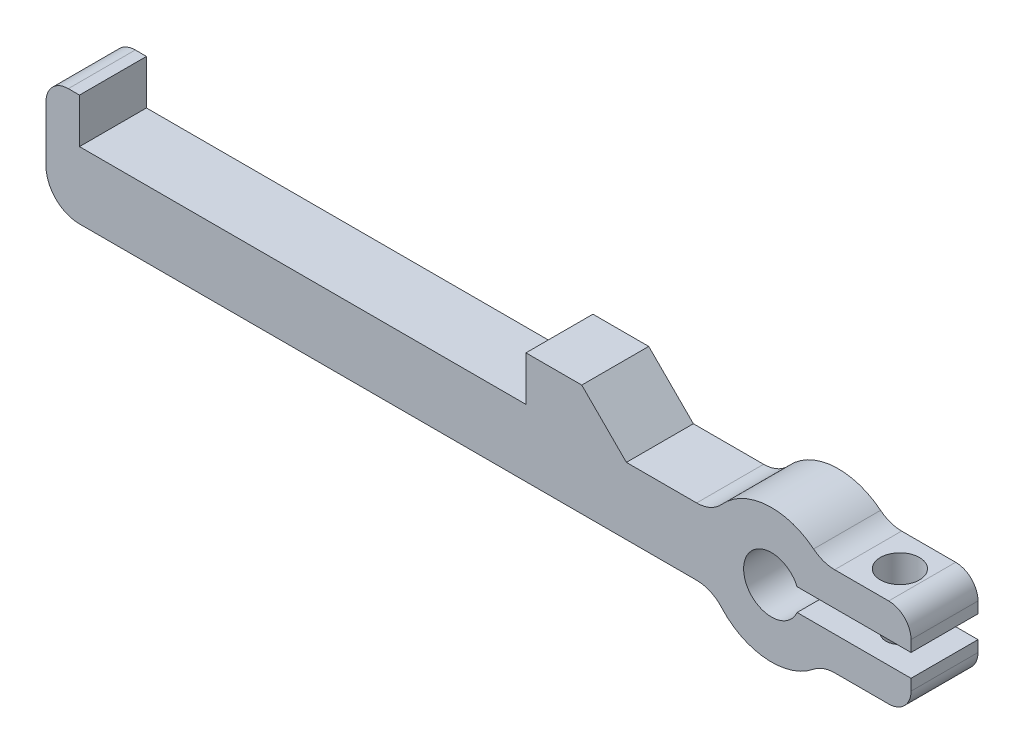
ISO-10303-21;
HEADER;
FILE_DESCRIPTION(('STEP AP214'),'2;1');
FILE_NAME('part.step','',(''),(''),'','','');
FILE_SCHEMA(('AUTOMOTIVE_DESIGN { 1 0 10303 214 1 1 1 1 }'));
ENDSEC;
DATA;
#1=APPLICATION_CONTEXT('core data for automotive mechanical design processes');
#2=APPLICATION_PROTOCOL_DEFINITION('international standard','automotive_design',2000,#1);
#3=PRODUCT_CONTEXT('',#1,'mechanical');
#4=PRODUCT('Part','Part','',(#3));
#5=PRODUCT_RELATED_PRODUCT_CATEGORY('part','',(#4));
#6=PRODUCT_DEFINITION_FORMATION('','',#4);
#7=PRODUCT_DEFINITION_CONTEXT('part definition',#1,'design');
#8=PRODUCT_DEFINITION('design','',#6,#7);
#9=PRODUCT_DEFINITION_SHAPE('','',#8);
#10=(LENGTH_UNIT() NAMED_UNIT(*) SI_UNIT(.MILLI.,.METRE.));
#11=(NAMED_UNIT(*) PLANE_ANGLE_UNIT() SI_UNIT($,.RADIAN.));
#12=(NAMED_UNIT(*) SI_UNIT($,.STERADIAN.) SOLID_ANGLE_UNIT());
#13=UNCERTAINTY_MEASURE_WITH_UNIT(LENGTH_MEASURE(1.E-05),#10,'distance_accuracy_value','');
#14=(GEOMETRIC_REPRESENTATION_CONTEXT(3) GLOBAL_UNCERTAINTY_ASSIGNED_CONTEXT((#13)) GLOBAL_UNIT_ASSIGNED_CONTEXT((#10,
#11,#12)) REPRESENTATION_CONTEXT('',''));
#15=CARTESIAN_POINT('',(0.,0.,0.));
#16=DIRECTION('',(0.,0.,1.));
#17=DIRECTION('',(1.,0.,0.));
#18=AXIS2_PLACEMENT_3D('',#15,#16,#17);
#19=CARTESIAN_POINT('',(-65.,3.,-62.2896460095897));
#20=DIRECTION('',(0.,1.,0.));
#21=DIRECTION('',(0.,0.,1.));
#22=AXIS2_PLACEMENT_3D('',#19,#20,#21);
#23=PLANE('',#22);
#24=DIRECTION('',(1.,0.,0.));
#25=VECTOR('',#24,1.);
#26=CARTESIAN_POINT('',(-65.,3.,0.));
#27=LINE('',#26,#25);
#28=CARTESIAN_POINT('',(-12.9999999999999,3.,0.));
#29=VERTEX_POINT('',#28);
#30=CARTESIAN_POINT('',(-6.70820393249937,3.,0.));
#31=VERTEX_POINT('',#30);
#32=EDGE_CURVE('E298',#29,#31,#27,.T.);
#33=ORIENTED_EDGE('',*,*,#32,.F.);
#34=DIRECTION('',(0.,0.,1.));
#35=VECTOR('',#34,1.);
#36=CARTESIAN_POINT('',(-12.9999999999999,3.,6.));
#37=LINE('',#36,#35);
#38=CARTESIAN_POINT('',(-12.9999999999999,3.,6.));
#39=VERTEX_POINT('',#38);
#40=EDGE_CURVE('E393',#29,#39,#37,.T.);
#41=ORIENTED_EDGE('',*,*,#40,.T.);
#42=DIRECTION('',(-1.,0.,0.));
#43=VECTOR('',#42,1.);
#44=CARTESIAN_POINT('',(-65.,3.,6.));
#45=LINE('',#44,#43);
#46=CARTESIAN_POINT('',(-6.70820393249937,3.,6.));
#47=VERTEX_POINT('',#46);
#48=EDGE_CURVE('E306',#47,#39,#45,.T.);
#49=ORIENTED_EDGE('',*,*,#48,.F.);
#50=DIRECTION('',(0.,0.,-1.));
#51=VECTOR('',#50,1.);
#52=CARTESIAN_POINT('',(-6.70820393249937,3.,-62.2896460095897));
#53=LINE('',#52,#51);
#54=EDGE_CURVE('E354',#47,#31,#53,.T.);
#55=ORIENTED_EDGE('',*,*,#54,.T.);
#56=EDGE_LOOP('',(#33,#41,#49,#55));
#57=FACE_BOUND('',#56,.T.);
#58=ADVANCED_FACE('F32',(#57),#23,.T.);
#59=CARTESIAN_POINT('',(12.5,4.,-12.8062484748657));
#60=DIRECTION('',(1.,0.,0.));
#61=DIRECTION('',(0.,0.,-1.));
#62=AXIS2_PLACEMENT_3D('',#59,#60,#61);
#63=PLANE('',#62);
#64=DIRECTION('',(0.,1.,0.));
#65=VECTOR('',#64,1.);
#66=CARTESIAN_POINT('',(12.5,4.,6.));
#67=LINE('',#66,#65);
#68=CARTESIAN_POINT('',(12.5,-2.,6.));
#69=VERTEX_POINT('',#68);
#70=CARTESIAN_POINT('',(12.5,-0.999999999999998,6.));
#71=VERTEX_POINT('',#70);
#72=EDGE_CURVE('E290',#69,#71,#67,.T.);
#73=ORIENTED_EDGE('',*,*,#72,.F.);
#74=DIRECTION('',(0.,0.,1.));
#75=VECTOR('',#74,1.);
#76=CARTESIAN_POINT('',(12.5,-2.,-12.8062484748657));
#77=LINE('',#76,#75);
#78=CARTESIAN_POINT('',(12.5,-2.,0.));
#79=VERTEX_POINT('',#78);
#80=EDGE_CURVE('E382',#69,#79,#77,.F.);
#81=ORIENTED_EDGE('',*,*,#80,.T.);
#82=DIRECTION('',(0.,-1.,0.));
#83=VECTOR('',#82,1.);
#84=CARTESIAN_POINT('',(12.5,4.,0.));
#85=LINE('',#84,#83);
#86=CARTESIAN_POINT('',(12.5,-0.999999999999999,0.));
#87=VERTEX_POINT('',#86);
#88=EDGE_CURVE('E283',#87,#79,#85,.T.);
#89=ORIENTED_EDGE('',*,*,#88,.F.);
#90=DIRECTION('',(0.,0.,1.));
#91=VECTOR('',#90,1.);
#92=CARTESIAN_POINT('',(12.5,-0.999999999999999,0.));
#93=LINE('',#92,#91);
#94=EDGE_CURVE('E266',#87,#71,#93,.T.);
#95=ORIENTED_EDGE('',*,*,#94,.T.);
#96=EDGE_LOOP('',(#73,#81,#89,#95));
#97=FACE_BOUND('',#96,.T.);
#98=ADVANCED_FACE('F425',(#97),#63,.T.);
#99=CARTESIAN_POINT('',(0.,0.,6.));
#100=DIRECTION('',(0.,0.,-1.));
#101=DIRECTION('',(-1.,0.,0.));
#102=AXIS2_PLACEMENT_3D('',#99,#100,#101);
#103=CYLINDRICAL_SURFACE('',#102,6.);
#104=CARTESIAN_POINT('',(0.,0.,6.));
#105=DIRECTION('',(0.,0.,1.));
#106=DIRECTION('',(1.,0.,0.));
#107=AXIS2_PLACEMENT_3D('',#104,#105,#106);
#108=CIRCLE('',#107,6.);
#109=CARTESIAN_POINT('',(3.77123616632825,4.66666666666667,6.));
#110=VERTEX_POINT('',#109);
#111=CARTESIAN_POINT('',(-4.47213595499958,4.,6.));
#112=VERTEX_POINT('',#111);
#113=EDGE_CURVE('E322',#110,#112,#108,.T.);
#114=ORIENTED_EDGE('',*,*,#113,.F.);
#115=DIRECTION('',(0.,0.,-1.));
#116=VECTOR('',#115,1.);
#117=CARTESIAN_POINT('',(3.77123616632826,4.66666666666667,6.));
#118=LINE('',#117,#116);
#119=CARTESIAN_POINT('',(3.77123616632825,4.66666666666667,0.));
#120=VERTEX_POINT('',#119);
#121=EDGE_CURVE('E348',#110,#120,#118,.T.);
#122=ORIENTED_EDGE('',*,*,#121,.T.);
#123=CARTESIAN_POINT('',(0.,0.,0.));
#124=DIRECTION('',(0.,0.,1.));
#125=DIRECTION('',(1.,0.,0.));
#126=AXIS2_PLACEMENT_3D('',#123,#124,#125);
#127=CIRCLE('',#126,6.);
#128=CARTESIAN_POINT('',(-4.47213595499958,4.,0.));
#129=VERTEX_POINT('',#128);
#130=EDGE_CURVE('E315',#120,#129,#127,.T.);
#131=ORIENTED_EDGE('',*,*,#130,.T.);
#132=DIRECTION('',(0.,0.,-1.));
#133=VECTOR('',#132,1.);
#134=CARTESIAN_POINT('',(-4.47213595499958,4.,6.));
#135=LINE('',#134,#133);
#136=EDGE_CURVE('E345',#129,#112,#135,.F.);
#137=ORIENTED_EDGE('',*,*,#136,.T.);
#138=EDGE_LOOP('',(#114,#122,#131,#137));
#139=FACE_BOUND('',#138,.T.);
#140=ADVANCED_FACE('F432',(#139),#103,.T.);
#141=CARTESIAN_POINT('',(0.,0.,6.));
#142=DIRECTION('',(0.,0.,1.));
#143=DIRECTION('',(1.,0.,0.));
#144=AXIS2_PLACEMENT_3D('',#141,#142,#143);
#145=PLANE('',#144);
#146=DIRECTION('',(-1.,0.,0.));
#147=VECTOR('',#146,1.);
#148=CARTESIAN_POINT('',(-65.,7.,6.));
#149=LINE('',#148,#147);
#150=CARTESIAN_POINT('',(-62.,7.00000000000001,6.));
#151=VERTEX_POINT('',#150);
#152=CARTESIAN_POINT('',(-63.,7.00000000000001,6.));
#153=VERTEX_POINT('',#152);
#154=EDGE_CURVE('E238',#151,#153,#149,.T.);
#155=ORIENTED_EDGE('',*,*,#154,.T.);
#156=CARTESIAN_POINT('',(-63.,5.00000000000001,6.));
#157=DIRECTION('',(0.,0.,1.));
#158=DIRECTION('',(1.,0.,0.));
#159=AXIS2_PLACEMENT_3D('',#156,#157,#158);
#160=CIRCLE('',#159,2.);
#161=CARTESIAN_POINT('',(-65.,5.00000000000001,6.));
#162=VERTEX_POINT('',#161);
#163=EDGE_CURVE('E54',#153,#162,#160,.T.);
#164=ORIENTED_EDGE('',*,*,#163,.T.);
#165=DIRECTION('',(0.,-1.,0.));
#166=VECTOR('',#165,1.);
#167=CARTESIAN_POINT('',(-65.,3.,6.));
#168=LINE('',#167,#166);
#169=CARTESIAN_POINT('',(-65.,0.,6.));
#170=VERTEX_POINT('',#169);
#171=EDGE_CURVE('E295',#162,#170,#168,.T.);
#172=ORIENTED_EDGE('',*,*,#171,.T.);
#173=CARTESIAN_POINT('',(-62.,0.,6.));
#174=DIRECTION('',(0.,0.,1.));
#175=DIRECTION('',(1.,0.,0.));
#176=AXIS2_PLACEMENT_3D('',#173,#174,#175);
#177=CIRCLE('',#176,3.);
#178=CARTESIAN_POINT('',(-62.,-3.,6.));
#179=VERTEX_POINT('',#178);
#180=EDGE_CURVE('E328',#170,#179,#177,.T.);
#181=ORIENTED_EDGE('',*,*,#180,.T.);
#182=DIRECTION('',(1.,0.,0.));
#183=VECTOR('',#182,1.);
#184=CARTESIAN_POINT('',(-65.,-3.,6.));
#185=LINE('',#184,#183);
#186=CARTESIAN_POINT('',(-6.70820393249937,-3.,6.));
#187=VERTEX_POINT('',#186);
#188=EDGE_CURVE('E302',#179,#187,#185,.T.);
#189=ORIENTED_EDGE('',*,*,#188,.T.);
#190=CARTESIAN_POINT('',(-6.70820393249937,-6.,6.));
#191=DIRECTION('',(0.,0.,1.));
#192=DIRECTION('',(1.,0.,0.));
#193=AXIS2_PLACEMENT_3D('',#190,#191,#192);
#194=CIRCLE('',#193,3.);
#195=CARTESIAN_POINT('',(-4.47213595499958,-4.,6.));
#196=VERTEX_POINT('',#195);
#197=EDGE_CURVE('E371',#187,#196,#194,.F.);
#198=ORIENTED_EDGE('',*,*,#197,.T.);
#199=CARTESIAN_POINT('',(3.77123616632826,-4.66666666666666,6.));
#200=VERTEX_POINT('',#199);
#201=EDGE_CURVE('E318',#196,#200,#108,.T.);
#202=ORIENTED_EDGE('',*,*,#201,.T.);
#203=CARTESIAN_POINT('',(5.65685424949238,-7.,6.));
#204=DIRECTION('',(0.,0.,1.));
#205=DIRECTION('',(1.,0.,0.));
#206=AXIS2_PLACEMENT_3D('',#203,#204,#205);
#207=CIRCLE('',#206,3.);
#208=CARTESIAN_POINT('',(5.65685424949238,-4.,6.));
#209=VERTEX_POINT('',#208);
#210=EDGE_CURVE('E357',#200,#209,#207,.F.);
#211=ORIENTED_EDGE('',*,*,#210,.T.);
#212=DIRECTION('',(1.,0.,0.));
#213=VECTOR('',#212,1.);
#214=CARTESIAN_POINT('',(2.5,-4.,6.));
#215=LINE('',#214,#213);
#216=CARTESIAN_POINT('',(10.5,-4.,6.));
#217=VERTEX_POINT('',#216);
#218=EDGE_CURVE('E279',#209,#217,#215,.T.);
#219=ORIENTED_EDGE('',*,*,#218,.T.);
#220=CARTESIAN_POINT('',(10.5,-2.,6.));
#221=DIRECTION('',(0.,0.,1.));
#222=DIRECTION('',(1.,0.,0.));
#223=AXIS2_PLACEMENT_3D('',#220,#221,#222);
#224=CIRCLE('',#223,2.);
#225=EDGE_CURVE('E380',#217,#69,#224,.T.);
#226=ORIENTED_EDGE('',*,*,#225,.T.);
#227=ORIENTED_EDGE('',*,*,#72,.T.);
#228=DIRECTION('',(1.,0.,0.));
#229=VECTOR('',#228,1.);
#230=CARTESIAN_POINT('',(0.,-1.,6.));
#231=LINE('',#230,#229);
#232=CARTESIAN_POINT('',(2.29128784747792,-1.,6.));
#233=VERTEX_POINT('',#232);
#234=EDGE_CURVE('E276',#233,#71,#231,.T.);
#235=ORIENTED_EDGE('',*,*,#234,.F.);
#236=CARTESIAN_POINT('',(0.,0.,6.));
#237=DIRECTION('',(0.,0.,1.));
#238=DIRECTION('',(1.,0.,0.));
#239=AXIS2_PLACEMENT_3D('',#236,#237,#238);
#240=CIRCLE('',#239,2.5);
#241=CARTESIAN_POINT('',(2.29128784747792,1.,6.));
#242=VERTEX_POINT('',#241);
#243=EDGE_CURVE('E312',#242,#233,#240,.T.);
#244=ORIENTED_EDGE('',*,*,#243,.F.);
#245=DIRECTION('',(-1.,0.,0.));
#246=VECTOR('',#245,1.);
#247=CARTESIAN_POINT('',(0.,1.,6.));
#248=LINE('',#247,#246);
#249=CARTESIAN_POINT('',(12.5,1.,6.));
#250=VERTEX_POINT('',#249);
#251=EDGE_CURVE('E272',#250,#242,#248,.T.);
#252=ORIENTED_EDGE('',*,*,#251,.F.);
#253=CARTESIAN_POINT('',(12.5,2.,6.));
#254=VERTEX_POINT('',#253);
#255=EDGE_CURVE('E289',#250,#254,#67,.T.);
#256=ORIENTED_EDGE('',*,*,#255,.T.);
#257=CARTESIAN_POINT('',(10.5,2.,6.));
#258=DIRECTION('',(0.,0.,1.));
#259=DIRECTION('',(1.,0.,0.));
#260=AXIS2_PLACEMENT_3D('',#257,#258,#259);
#261=CIRCLE('',#260,2.);
#262=CARTESIAN_POINT('',(10.5,4.,6.));
#263=VERTEX_POINT('',#262);
#264=EDGE_CURVE('E378',#254,#263,#261,.T.);
#265=ORIENTED_EDGE('',*,*,#264,.T.);
#266=DIRECTION('',(-1.,0.,0.));
#267=VECTOR('',#266,1.);
#268=CARTESIAN_POINT('',(2.5,4.,6.));
#269=LINE('',#268,#267);
#270=CARTESIAN_POINT('',(5.65685424949238,4.,6.));
#271=VERTEX_POINT('',#270);
#272=EDGE_CURVE('E292',#263,#271,#269,.T.);
#273=ORIENTED_EDGE('',*,*,#272,.T.);
#274=CARTESIAN_POINT('',(5.65685424949238,7.,6.));
#275=DIRECTION('',(0.,0.,1.));
#276=DIRECTION('',(1.,0.,0.));
#277=AXIS2_PLACEMENT_3D('',#274,#275,#276);
#278=CIRCLE('',#277,3.);
#279=EDGE_CURVE('E363',#271,#110,#278,.F.);
#280=ORIENTED_EDGE('',*,*,#279,.T.);
#281=ORIENTED_EDGE('',*,*,#113,.T.);
#282=CARTESIAN_POINT('',(-6.70820393249937,6.,6.));
#283=DIRECTION('',(0.,0.,1.));
#284=DIRECTION('',(1.,0.,0.));
#285=AXIS2_PLACEMENT_3D('',#282,#283,#284);
#286=CIRCLE('',#285,3.);
#287=EDGE_CURVE('E365',#112,#47,#286,.F.);
#288=ORIENTED_EDGE('',*,*,#287,.T.);
#289=ORIENTED_EDGE('',*,*,#48,.T.);
#290=DIRECTION('',(0.707106781186551,-0.707106781186544,0.));
#291=VECTOR('',#290,1.);
#292=CARTESIAN_POINT('',(-12.9999999999999,3.,6.));
#293=LINE('',#292,#291);
#294=CARTESIAN_POINT('',(-17.,7.00000000000002,6.));
#295=VERTEX_POINT('',#294);
#296=EDGE_CURVE('E396',#39,#295,#293,.F.);
#297=ORIENTED_EDGE('',*,*,#296,.T.);
#298=DIRECTION('',(-1.,0.,0.));
#299=VECTOR('',#298,1.);
#300=CARTESIAN_POINT('',(-19.,7.00000000000002,6.));
#301=LINE('',#300,#299);
#302=CARTESIAN_POINT('',(-22.,7.00000000000002,6.));
#303=VERTEX_POINT('',#302);
#304=EDGE_CURVE('E228',#295,#303,#301,.T.);
#305=ORIENTED_EDGE('',*,*,#304,.T.);
#306=DIRECTION('',(0.,-1.,0.));
#307=VECTOR('',#306,1.);
#308=CARTESIAN_POINT('',(-22.,3.,6.));
#309=LINE('',#308,#307);
#310=CARTESIAN_POINT('',(-22.,3.,6.));
#311=VERTEX_POINT('',#310);
#312=EDGE_CURVE('E209',#303,#311,#309,.T.);
#313=ORIENTED_EDGE('',*,*,#312,.T.);
#314=CARTESIAN_POINT('',(-62.,3.,6.));
#315=VERTEX_POINT('',#314);
#316=EDGE_CURVE('E305',#311,#315,#45,.T.);
#317=ORIENTED_EDGE('',*,*,#316,.T.);
#318=DIRECTION('',(0.,1.,0.));
#319=VECTOR('',#318,1.);
#320=CARTESIAN_POINT('',(-62.,2.99999999999999,6.));
#321=LINE('',#320,#319);
#322=EDGE_CURVE('E232',#315,#151,#321,.T.);
#323=ORIENTED_EDGE('',*,*,#322,.T.);
#324=EDGE_LOOP('',(#155,#164,#172,#181,#189,#198,#202,#211,#219,#226,#227,#235,#244,#252,#256,
#265,#273,#280,#281,#288,#289,#297,#305,#313,#317,#323));
#325=FACE_BOUND('',#324,.T.);
#326=ADVANCED_FACE('F412',(#325),#145,.T.);
#327=CARTESIAN_POINT('',(0.,0.,0.));
#328=DIRECTION('',(0.,0.,1.));
#329=DIRECTION('',(1.,0.,0.));
#330=AXIS2_PLACEMENT_3D('',#327,#328,#329);
#331=PLANE('',#330);
#332=DIRECTION('',(0.,1.,0.));
#333=VECTOR('',#332,1.);
#334=CARTESIAN_POINT('',(-65.,3.,0.));
#335=LINE('',#334,#333);
#336=CARTESIAN_POINT('',(-65.,0.,0.));
#337=VERTEX_POINT('',#336);
#338=CARTESIAN_POINT('',(-65.,5.00000000000001,0.));
#339=VERTEX_POINT('',#338);
#340=EDGE_CURVE('E297',#337,#339,#335,.T.);
#341=ORIENTED_EDGE('',*,*,#340,.T.);
#342=CARTESIAN_POINT('',(-63.,5.00000000000001,0.));
#343=DIRECTION('',(0.,0.,1.));
#344=DIRECTION('',(1.,0.,0.));
#345=AXIS2_PLACEMENT_3D('',#342,#343,#344);
#346=CIRCLE('',#345,2.);
#347=CARTESIAN_POINT('',(-63.,7.00000000000001,0.));
#348=VERTEX_POINT('',#347);
#349=EDGE_CURVE('E11',#339,#348,#346,.F.);
#350=ORIENTED_EDGE('',*,*,#349,.T.);
#351=DIRECTION('',(-1.,0.,0.));
#352=VECTOR('',#351,1.);
#353=CARTESIAN_POINT('',(-65.,7.,0.));
#354=LINE('',#353,#352);
#355=CARTESIAN_POINT('',(-62.,7.00000000000001,0.));
#356=VERTEX_POINT('',#355);
#357=EDGE_CURVE('E237',#356,#348,#354,.T.);
#358=ORIENTED_EDGE('',*,*,#357,.F.);
#359=DIRECTION('',(0.,1.,0.));
#360=VECTOR('',#359,1.);
#361=CARTESIAN_POINT('',(-62.,2.99999999999999,0.));
#362=LINE('',#361,#360);
#363=CARTESIAN_POINT('',(-62.,3.,0.));
#364=VERTEX_POINT('',#363);
#365=EDGE_CURVE('E234',#364,#356,#362,.T.);
#366=ORIENTED_EDGE('',*,*,#365,.F.);
#367=CARTESIAN_POINT('',(-22.,3.,0.));
#368=VERTEX_POINT('',#367);
#369=EDGE_CURVE('E221',#364,#368,#27,.T.);
#370=ORIENTED_EDGE('',*,*,#369,.T.);
#371=DIRECTION('',(0.,-1.,0.));
#372=VECTOR('',#371,1.);
#373=CARTESIAN_POINT('',(-22.,3.,0.));
#374=LINE('',#373,#372);
#375=CARTESIAN_POINT('',(-22.,7.00000000000002,0.));
#376=VERTEX_POINT('',#375);
#377=EDGE_CURVE('E207',#376,#368,#374,.T.);
#378=ORIENTED_EDGE('',*,*,#377,.F.);
#379=DIRECTION('',(-1.,0.,0.));
#380=VECTOR('',#379,1.);
#381=CARTESIAN_POINT('',(-19.,7.00000000000002,0.));
#382=LINE('',#381,#380);
#383=CARTESIAN_POINT('',(-17.,7.00000000000002,0.));
#384=VERTEX_POINT('',#383);
#385=EDGE_CURVE('E218',#384,#376,#382,.T.);
#386=ORIENTED_EDGE('',*,*,#385,.F.);
#387=DIRECTION('',(-0.707106781186551,0.707106781186544,0.));
#388=VECTOR('',#387,1.);
#389=CARTESIAN_POINT('',(-4.99999999999987,-4.99999999999993,0.));
#390=LINE('',#389,#388);
#391=EDGE_CURVE('E400',#384,#29,#390,.F.);
#392=ORIENTED_EDGE('',*,*,#391,.T.);
#393=ORIENTED_EDGE('',*,*,#32,.T.);
#394=CARTESIAN_POINT('',(-6.70820393249937,6.,0.));
#395=DIRECTION('',(0.,0.,1.));
#396=DIRECTION('',(1.,0.,0.));
#397=AXIS2_PLACEMENT_3D('',#394,#395,#396);
#398=CIRCLE('',#397,3.);
#399=EDGE_CURVE('E367',#31,#129,#398,.T.);
#400=ORIENTED_EDGE('',*,*,#399,.T.);
#401=ORIENTED_EDGE('',*,*,#130,.F.);
#402=CARTESIAN_POINT('',(5.65685424949238,7.,0.));
#403=DIRECTION('',(0.,0.,1.));
#404=DIRECTION('',(1.,0.,0.));
#405=AXIS2_PLACEMENT_3D('',#402,#403,#404);
#406=CIRCLE('',#405,3.);
#407=CARTESIAN_POINT('',(5.65685424949238,4.,0.));
#408=VERTEX_POINT('',#407);
#409=EDGE_CURVE('E361',#120,#408,#406,.T.);
#410=ORIENTED_EDGE('',*,*,#409,.T.);
#411=DIRECTION('',(1.,0.,0.));
#412=VECTOR('',#411,1.);
#413=CARTESIAN_POINT('',(2.5,4.,0.));
#414=LINE('',#413,#412);
#415=CARTESIAN_POINT('',(10.5,4.,0.));
#416=VERTEX_POINT('',#415);
#417=EDGE_CURVE('E282',#408,#416,#414,.T.);
#418=ORIENTED_EDGE('',*,*,#417,.T.);
#419=CARTESIAN_POINT('',(10.5,2.,0.));
#420=DIRECTION('',(0.,0.,1.));
#421=DIRECTION('',(1.,0.,0.));
#422=AXIS2_PLACEMENT_3D('',#419,#420,#421);
#423=CIRCLE('',#422,2.);
#424=CARTESIAN_POINT('',(12.5,2.,0.));
#425=VERTEX_POINT('',#424);
#426=EDGE_CURVE('E384',#416,#425,#423,.F.);
#427=ORIENTED_EDGE('',*,*,#426,.T.);
#428=CARTESIAN_POINT('',(12.5,1.,0.));
#429=VERTEX_POINT('',#428);
#430=EDGE_CURVE('E280',#425,#429,#85,.T.);
#431=ORIENTED_EDGE('',*,*,#430,.T.);
#432=DIRECTION('',(-1.,0.,0.));
#433=VECTOR('',#432,1.);
#434=CARTESIAN_POINT('',(12.5,1.,0.));
#435=LINE('',#434,#433);
#436=CARTESIAN_POINT('',(2.29128784747792,1.,0.));
#437=VERTEX_POINT('',#436);
#438=EDGE_CURVE('E259',#429,#437,#435,.T.);
#439=ORIENTED_EDGE('',*,*,#438,.T.);
#440=CARTESIAN_POINT('',(0.,0.,0.));
#441=DIRECTION('',(0.,0.,1.));
#442=DIRECTION('',(1.,0.,0.));
#443=AXIS2_PLACEMENT_3D('',#440,#441,#442);
#444=CIRCLE('',#443,2.5);
#445=CARTESIAN_POINT('',(2.29128784747792,-1.,0.));
#446=VERTEX_POINT('',#445);
#447=EDGE_CURVE('E311',#437,#446,#444,.T.);
#448=ORIENTED_EDGE('',*,*,#447,.T.);
#449=DIRECTION('',(1.,0.,0.));
#450=VECTOR('',#449,1.);
#451=CARTESIAN_POINT('',(12.5,-0.999999999999999,0.));
#452=LINE('',#451,#450);
#453=EDGE_CURVE('E262',#446,#87,#452,.T.);
#454=ORIENTED_EDGE('',*,*,#453,.T.);
#455=ORIENTED_EDGE('',*,*,#88,.T.);
#456=CARTESIAN_POINT('',(10.5,-2.,0.));
#457=DIRECTION('',(0.,0.,1.));
#458=DIRECTION('',(1.,0.,0.));
#459=AXIS2_PLACEMENT_3D('',#456,#457,#458);
#460=CIRCLE('',#459,2.);
#461=CARTESIAN_POINT('',(10.5,-4.,0.));
#462=VERTEX_POINT('',#461);
#463=EDGE_CURVE('E386',#79,#462,#460,.F.);
#464=ORIENTED_EDGE('',*,*,#463,.T.);
#465=DIRECTION('',(-1.,0.,0.));
#466=VECTOR('',#465,1.);
#467=CARTESIAN_POINT('',(2.5,-4.,0.));
#468=LINE('',#467,#466);
#469=CARTESIAN_POINT('',(5.65685424949238,-4.,0.));
#470=VERTEX_POINT('',#469);
#471=EDGE_CURVE('E286',#462,#470,#468,.T.);
#472=ORIENTED_EDGE('',*,*,#471,.T.);
#473=CARTESIAN_POINT('',(5.65685424949238,-7.,0.));
#474=DIRECTION('',(0.,0.,1.));
#475=DIRECTION('',(1.,0.,0.));
#476=AXIS2_PLACEMENT_3D('',#473,#474,#475);
#477=CIRCLE('',#476,3.);
#478=CARTESIAN_POINT('',(3.77123616632826,-4.66666666666666,0.));
#479=VERTEX_POINT('',#478);
#480=EDGE_CURVE('E359',#470,#479,#477,.T.);
#481=ORIENTED_EDGE('',*,*,#480,.T.);
#482=CARTESIAN_POINT('',(-4.47213595499958,-4.,0.));
#483=VERTEX_POINT('',#482);
#484=EDGE_CURVE('E323',#483,#479,#127,.T.);
#485=ORIENTED_EDGE('',*,*,#484,.F.);
#486=CARTESIAN_POINT('',(-6.70820393249937,-6.,0.));
#487=DIRECTION('',(0.,0.,1.));
#488=DIRECTION('',(1.,0.,0.));
#489=AXIS2_PLACEMENT_3D('',#486,#487,#488);
#490=CIRCLE('',#489,3.);
#491=CARTESIAN_POINT('',(-6.70820393249937,-3.,0.));
#492=VERTEX_POINT('',#491);
#493=EDGE_CURVE('E369',#483,#492,#490,.T.);
#494=ORIENTED_EDGE('',*,*,#493,.T.);
#495=DIRECTION('',(-1.,0.,0.));
#496=VECTOR('',#495,1.);
#497=CARTESIAN_POINT('',(-65.,-3.,0.));
#498=LINE('',#497,#496);
#499=CARTESIAN_POINT('',(-62.,-3.,0.));
#500=VERTEX_POINT('',#499);
#501=EDGE_CURVE('E300',#492,#500,#498,.T.);
#502=ORIENTED_EDGE('',*,*,#501,.T.);
#503=CARTESIAN_POINT('',(-62.,0.,0.));
#504=DIRECTION('',(0.,0.,1.));
#505=DIRECTION('',(1.,0.,0.));
#506=AXIS2_PLACEMENT_3D('',#503,#504,#505);
#507=CIRCLE('',#506,3.);
#508=EDGE_CURVE('E334',#500,#337,#507,.F.);
#509=ORIENTED_EDGE('',*,*,#508,.T.);
#510=EDGE_LOOP('',(#341,#350,#358,#366,#370,#378,#386,#392,#393,#400,#401,#410,#418,#427,#431,
#439,#448,#454,#455,#464,#472,#481,#485,#494,#502,#509));
#511=FACE_BOUND('',#510,.T.);
#512=ADVANCED_FACE('F217',(#511),#331,.F.);
#513=ORIENTED_EDGE('',*,*,#484,.T.);
#514=DIRECTION('',(0.,0.,-1.));
#515=VECTOR('',#514,1.);
#516=CARTESIAN_POINT('',(3.77123616632826,-4.66666666666667,6.));
#517=LINE('',#516,#515);
#518=EDGE_CURVE('E339',#479,#200,#517,.F.);
#519=ORIENTED_EDGE('',*,*,#518,.T.);
#520=ORIENTED_EDGE('',*,*,#201,.F.);
#521=DIRECTION('',(0.,0.,-1.));
#522=VECTOR('',#521,1.);
#523=CARTESIAN_POINT('',(-4.47213595499958,-4.,6.));
#524=LINE('',#523,#522);
#525=EDGE_CURVE('E336',#196,#483,#524,.T.);
#526=ORIENTED_EDGE('',*,*,#525,.T.);
#527=EDGE_LOOP('',(#513,#519,#520,#526));
#528=FACE_BOUND('',#527,.T.);
#529=ADVANCED_FACE('F449',(#528),#103,.T.);
#530=CARTESIAN_POINT('',(0.,0.,6.));
#531=DIRECTION('',(0.,0.,-1.));
#532=DIRECTION('',(-1.,0.,0.));
#533=AXIS2_PLACEMENT_3D('',#530,#531,#532);
#534=CYLINDRICAL_SURFACE('',#533,2.5);
#535=DIRECTION('',(0.,0.,-1.));
#536=VECTOR('',#535,1.);
#537=CARTESIAN_POINT('',(2.29128784747792,-1.,6.));
#538=LINE('',#537,#536);
#539=EDGE_CURVE('E274',#446,#233,#538,.F.);
#540=ORIENTED_EDGE('',*,*,#539,.F.);
#541=ORIENTED_EDGE('',*,*,#447,.F.);
#542=DIRECTION('',(0.,0.,-1.));
#543=VECTOR('',#542,1.);
#544=CARTESIAN_POINT('',(2.29128784747792,1.,6.));
#545=LINE('',#544,#543);
#546=EDGE_CURVE('E269',#242,#437,#545,.T.);
#547=ORIENTED_EDGE('',*,*,#546,.F.);
#548=ORIENTED_EDGE('',*,*,#243,.T.);
#549=EDGE_LOOP('',(#540,#541,#547,#548));
#550=FACE_BOUND('',#549,.T.);
#551=ADVANCED_FACE('F441',(#550),#534,.F.);
#552=DIRECTION('',(0.,0.,1.));
#553=VECTOR('',#552,1.);
#554=CARTESIAN_POINT('',(-22.,3.,0.));
#555=LINE('',#554,#553);
#556=EDGE_CURVE('E213',#368,#311,#555,.T.);
#557=ORIENTED_EDGE('',*,*,#556,.F.);
#558=ORIENTED_EDGE('',*,*,#369,.F.);
#559=DIRECTION('',(0.,0.,1.));
#560=VECTOR('',#559,1.);
#561=CARTESIAN_POINT('',(-62.,2.99999999999999,0.));
#562=LINE('',#561,#560);
#563=EDGE_CURVE('E241',#364,#315,#562,.T.);
#564=ORIENTED_EDGE('',*,*,#563,.T.);
#565=ORIENTED_EDGE('',*,*,#316,.F.);
#566=EDGE_LOOP('',(#557,#558,#564,#565));
#567=FACE_BOUND('',#566,.T.);
#568=ADVANCED_FACE('F428',(#567),#23,.T.);
#569=CARTESIAN_POINT('',(-65.,-3.,-62.2896460095897));
#570=DIRECTION('',(0.,-1.,0.));
#571=DIRECTION('',(0.,0.,-1.));
#572=AXIS2_PLACEMENT_3D('',#569,#570,#571);
#573=PLANE('',#572);
#574=ORIENTED_EDGE('',*,*,#188,.F.);
#575=DIRECTION('',(0.,0.,1.));
#576=VECTOR('',#575,1.);
#577=CARTESIAN_POINT('',(-62.,-3.,-62.2896460095897));
#578=LINE('',#577,#576);
#579=EDGE_CURVE('E332',#179,#500,#578,.F.);
#580=ORIENTED_EDGE('',*,*,#579,.T.);
#581=ORIENTED_EDGE('',*,*,#501,.F.);
#582=DIRECTION('',(0.,0.,-1.));
#583=VECTOR('',#582,1.);
#584=CARTESIAN_POINT('',(-6.70820393249937,-3.,-62.2896460095897));
#585=LINE('',#584,#583);
#586=EDGE_CURVE('E330',#492,#187,#585,.F.);
#587=ORIENTED_EDGE('',*,*,#586,.T.);
#588=EDGE_LOOP('',(#574,#580,#581,#587));
#589=FACE_BOUND('',#588,.T.);
#590=ADVANCED_FACE('F440',(#589),#573,.T.);
#591=CARTESIAN_POINT('',(-65.,3.,-62.2896460095897));
#592=DIRECTION('',(-1.,0.,0.));
#593=DIRECTION('',(0.,0.,1.));
#594=AXIS2_PLACEMENT_3D('',#591,#592,#593);
#595=PLANE('',#594);
#596=ORIENTED_EDGE('',*,*,#171,.F.);
#597=DIRECTION('',(0.,0.,1.));
#598=VECTOR('',#597,1.);
#599=CARTESIAN_POINT('',(-65.,5.00000000000001,-62.2896460095897));
#600=LINE('',#599,#598);
#601=EDGE_CURVE('E40',#162,#339,#600,.F.);
#602=ORIENTED_EDGE('',*,*,#601,.T.);
#603=ORIENTED_EDGE('',*,*,#340,.F.);
#604=DIRECTION('',(0.,0.,1.));
#605=VECTOR('',#604,1.);
#606=CARTESIAN_POINT('',(-65.,0.,-62.2896460095897));
#607=LINE('',#606,#605);
#608=EDGE_CURVE('E321',#337,#170,#607,.T.);
#609=ORIENTED_EDGE('',*,*,#608,.T.);
#610=EDGE_LOOP('',(#596,#602,#603,#609));
#611=FACE_BOUND('',#610,.T.);
#612=ADVANCED_FACE('F447',(#611),#595,.T.);
#613=CARTESIAN_POINT('',(2.5,4.,-12.8062484748657));
#614=DIRECTION('',(0.,1.,0.));
#615=DIRECTION('',(-1.,0.,0.));
#616=AXIS2_PLACEMENT_3D('',#613,#614,#615);
#617=PLANE('',#616);
#618=CARTESIAN_POINT('',(8.5,4.,3.));
#619=DIRECTION('',(0.,1.,0.));
#620=DIRECTION('',(-1.,0.,0.));
#621=AXIS2_PLACEMENT_3D('',#618,#619,#620);
#622=CIRCLE('',#621,1.75);
#623=CARTESIAN_POINT('',(6.75,4.,3.));
#624=VERTEX_POINT('',#623);
#625=EDGE_CURVE('E247',#624,#624,#622,.T.);
#626=ORIENTED_EDGE('',*,*,#625,.F.);
#627=EDGE_LOOP('',(#626));
#628=FACE_BOUND('',#627,.T.);
#629=ORIENTED_EDGE('',*,*,#272,.F.);
#630=DIRECTION('',(0.,0.,1.));
#631=VECTOR('',#630,1.);
#632=CARTESIAN_POINT('',(10.5,4.,-12.8062484748657));
#633=LINE('',#632,#631);
#634=EDGE_CURVE('E391',#263,#416,#633,.F.);
#635=ORIENTED_EDGE('',*,*,#634,.T.);
#636=ORIENTED_EDGE('',*,*,#417,.F.);
#637=DIRECTION('',(0.,0.,-1.));
#638=VECTOR('',#637,1.);
#639=CARTESIAN_POINT('',(5.65685424949238,4.,-12.8062484748657));
#640=LINE('',#639,#638);
#641=EDGE_CURVE('E351',#408,#271,#640,.F.);
#642=ORIENTED_EDGE('',*,*,#641,.T.);
#643=EDGE_LOOP('',(#629,#635,#636,#642));
#644=FACE_BOUND('',#643,.T.);
#645=ADVANCED_FACE('F553',(#628,#644),#617,.T.);
#646=CARTESIAN_POINT('',(2.5,-4.,-12.8062484748657));
#647=DIRECTION('',(0.,-1.,0.));
#648=DIRECTION('',(0.,0.,-1.));
#649=AXIS2_PLACEMENT_3D('',#646,#647,#648);
#650=PLANE('',#649);
#651=CARTESIAN_POINT('',(8.5,-4.,3.));
#652=DIRECTION('',(0.,-1.,0.));
#653=DIRECTION('',(0.,0.,-1.));
#654=AXIS2_PLACEMENT_3D('',#651,#652,#653);
#655=CIRCLE('',#654,1.25);
#656=CARTESIAN_POINT('',(8.5,-4.,1.75));
#657=VERTEX_POINT('',#656);
#658=EDGE_CURVE('E256',#657,#657,#655,.T.);
#659=ORIENTED_EDGE('',*,*,#658,.F.);
#660=EDGE_LOOP('',(#659));
#661=FACE_BOUND('',#660,.T.);
#662=ORIENTED_EDGE('',*,*,#471,.F.);
#663=DIRECTION('',(0.,0.,1.));
#664=VECTOR('',#663,1.);
#665=CARTESIAN_POINT('',(10.5,-4.,-12.8062484748657));
#666=LINE('',#665,#664);
#667=EDGE_CURVE('E373',#462,#217,#666,.T.);
#668=ORIENTED_EDGE('',*,*,#667,.T.);
#669=ORIENTED_EDGE('',*,*,#218,.F.);
#670=DIRECTION('',(0.,0.,-1.));
#671=VECTOR('',#670,1.);
#672=CARTESIAN_POINT('',(5.65685424949238,-4.,-12.8062484748657));
#673=LINE('',#672,#671);
#674=EDGE_CURVE('E342',#209,#470,#673,.T.);
#675=ORIENTED_EDGE('',*,*,#674,.T.);
#676=EDGE_LOOP('',(#662,#668,#669,#675));
#677=FACE_BOUND('',#676,.T.);
#678=ADVANCED_FACE('F522',(#661,#677),#650,.T.);
#679=ORIENTED_EDGE('',*,*,#430,.F.);
#680=DIRECTION('',(0.,0.,1.));
#681=VECTOR('',#680,1.);
#682=CARTESIAN_POINT('',(12.5,2.,-12.8062484748657));
#683=LINE('',#682,#681);
#684=EDGE_CURVE('E388',#425,#254,#683,.T.);
#685=ORIENTED_EDGE('',*,*,#684,.T.);
#686=ORIENTED_EDGE('',*,*,#255,.F.);
#687=DIRECTION('',(0.,0.,1.));
#688=VECTOR('',#687,1.);
#689=CARTESIAN_POINT('',(12.5,1.,0.));
#690=LINE('',#689,#688);
#691=EDGE_CURVE('E265',#429,#250,#690,.T.);
#692=ORIENTED_EDGE('',*,*,#691,.F.);
#693=EDGE_LOOP('',(#679,#685,#686,#692));
#694=FACE_BOUND('',#693,.T.);
#695=ADVANCED_FACE('F435',(#694),#63,.T.);
#696=CARTESIAN_POINT('',(-62.,0.,-62.2896460095897));
#697=DIRECTION('',(0.,0.,1.));
#698=DIRECTION('',(1.,0.,0.));
#699=AXIS2_PLACEMENT_3D('',#696,#697,#698);
#700=CYLINDRICAL_SURFACE('',#699,3.);
#701=ORIENTED_EDGE('',*,*,#508,.F.);
#702=ORIENTED_EDGE('',*,*,#579,.F.);
#703=ORIENTED_EDGE('',*,*,#180,.F.);
#704=ORIENTED_EDGE('',*,*,#608,.F.);
#705=EDGE_LOOP('',(#701,#702,#703,#704));
#706=FACE_BOUND('',#705,.T.);
#707=ADVANCED_FACE('F464',(#706),#700,.T.);
#708=CARTESIAN_POINT('',(5.65685424949238,-7.,6.));
#709=DIRECTION('',(0.,0.,-1.));
#710=DIRECTION('',(-1.,0.,0.));
#711=AXIS2_PLACEMENT_3D('',#708,#709,#710);
#712=CYLINDRICAL_SURFACE('',#711,3.);
#713=ORIENTED_EDGE('',*,*,#480,.F.);
#714=ORIENTED_EDGE('',*,*,#674,.F.);
#715=ORIENTED_EDGE('',*,*,#210,.F.);
#716=ORIENTED_EDGE('',*,*,#518,.F.);
#717=EDGE_LOOP('',(#713,#714,#715,#716));
#718=FACE_BOUND('',#717,.T.);
#719=ADVANCED_FACE('F467',(#718),#712,.F.);
#720=CARTESIAN_POINT('',(5.65685424949238,7.,6.));
#721=DIRECTION('',(0.,0.,-1.));
#722=DIRECTION('',(-1.,0.,0.));
#723=AXIS2_PLACEMENT_3D('',#720,#721,#722);
#724=CYLINDRICAL_SURFACE('',#723,3.);
#725=ORIENTED_EDGE('',*,*,#279,.F.);
#726=ORIENTED_EDGE('',*,*,#641,.F.);
#727=ORIENTED_EDGE('',*,*,#409,.F.);
#728=ORIENTED_EDGE('',*,*,#121,.F.);
#729=EDGE_LOOP('',(#725,#726,#727,#728));
#730=FACE_BOUND('',#729,.T.);
#731=ADVANCED_FACE('F471',(#730),#724,.F.);
#732=CARTESIAN_POINT('',(-6.70820393249937,6.,6.));
#733=DIRECTION('',(0.,0.,-1.));
#734=DIRECTION('',(-1.,0.,0.));
#735=AXIS2_PLACEMENT_3D('',#732,#733,#734);
#736=CYLINDRICAL_SURFACE('',#735,3.);
#737=ORIENTED_EDGE('',*,*,#399,.F.);
#738=ORIENTED_EDGE('',*,*,#54,.F.);
#739=ORIENTED_EDGE('',*,*,#287,.F.);
#740=ORIENTED_EDGE('',*,*,#136,.F.);
#741=EDGE_LOOP('',(#737,#738,#739,#740));
#742=FACE_BOUND('',#741,.T.);
#743=ADVANCED_FACE('F475',(#742),#736,.F.);
#744=CARTESIAN_POINT('',(-6.70820393249937,-6.,6.));
#745=DIRECTION('',(0.,0.,-1.));
#746=DIRECTION('',(-1.,0.,0.));
#747=AXIS2_PLACEMENT_3D('',#744,#745,#746);
#748=CYLINDRICAL_SURFACE('',#747,3.);
#749=ORIENTED_EDGE('',*,*,#197,.F.);
#750=ORIENTED_EDGE('',*,*,#586,.F.);
#751=ORIENTED_EDGE('',*,*,#493,.F.);
#752=ORIENTED_EDGE('',*,*,#525,.F.);
#753=EDGE_LOOP('',(#749,#750,#751,#752));
#754=FACE_BOUND('',#753,.T.);
#755=ADVANCED_FACE('F479',(#754),#748,.F.);
#756=CARTESIAN_POINT('',(12.5,1.,0.));
#757=DIRECTION('',(0.,1.,0.));
#758=DIRECTION('',(-1.,0.,0.));
#759=AXIS2_PLACEMENT_3D('',#756,#757,#758);
#760=PLANE('',#759);
#761=CARTESIAN_POINT('',(8.5,1.,3.));
#762=DIRECTION('',(0.,1.,0.));
#763=DIRECTION('',(-1.,0.,0.));
#764=AXIS2_PLACEMENT_3D('',#761,#762,#763);
#765=CIRCLE('',#764,1.75);
#766=CARTESIAN_POINT('',(6.75,0.999999999999999,3.));
#767=VERTEX_POINT('',#766);
#768=EDGE_CURVE('E250',#767,#767,#765,.T.);
#769=ORIENTED_EDGE('',*,*,#768,.T.);
#770=EDGE_LOOP('',(#769));
#771=FACE_BOUND('',#770,.T.);
#772=ORIENTED_EDGE('',*,*,#251,.T.);
#773=ORIENTED_EDGE('',*,*,#546,.T.);
#774=ORIENTED_EDGE('',*,*,#438,.F.);
#775=ORIENTED_EDGE('',*,*,#691,.T.);
#776=EDGE_LOOP('',(#772,#773,#774,#775));
#777=FACE_BOUND('',#776,.T.);
#778=ADVANCED_FACE('F483',(#771,#777),#760,.F.);
#779=CARTESIAN_POINT('',(12.5,-0.999999999999999,0.));
#780=DIRECTION('',(0.,-1.,0.));
#781=DIRECTION('',(1.,0.,0.));
#782=AXIS2_PLACEMENT_3D('',#779,#780,#781);
#783=PLANE('',#782);
#784=CARTESIAN_POINT('',(8.5,-0.999999999999999,3.));
#785=DIRECTION('',(0.,-1.,0.));
#786=DIRECTION('',(1.,0.,0.));
#787=AXIS2_PLACEMENT_3D('',#784,#785,#786);
#788=CIRCLE('',#787,1.25);
#789=CARTESIAN_POINT('',(9.75,-0.999999999999999,3.));
#790=VERTEX_POINT('',#789);
#791=EDGE_CURVE('E253',#790,#790,#788,.T.);
#792=ORIENTED_EDGE('',*,*,#791,.T.);
#793=EDGE_LOOP('',(#792));
#794=FACE_BOUND('',#793,.T.);
#795=ORIENTED_EDGE('',*,*,#234,.T.);
#796=ORIENTED_EDGE('',*,*,#94,.F.);
#797=ORIENTED_EDGE('',*,*,#453,.F.);
#798=ORIENTED_EDGE('',*,*,#539,.T.);
#799=EDGE_LOOP('',(#795,#796,#797,#798));
#800=FACE_BOUND('',#799,.T.);
#801=ADVANCED_FACE('F538',(#794,#800),#783,.F.);
#802=CARTESIAN_POINT('',(8.50000000000001,-6.,3.));
#803=DIRECTION('',(0.,1.,0.));
#804=DIRECTION('',(-1.,0.,0.));
#805=AXIS2_PLACEMENT_3D('',#802,#803,#804);
#806=CYLINDRICAL_SURFACE('',#805,1.25);
#807=ORIENTED_EDGE('',*,*,#658,.T.);
#808=EDGE_LOOP('',(#807));
#809=FACE_BOUND('',#808,.T.);
#810=ORIENTED_EDGE('',*,*,#791,.F.);
#811=EDGE_LOOP('',(#810));
#812=FACE_BOUND('',#811,.T.);
#813=ADVANCED_FACE('F540',(#809,#812),#806,.F.);
#814=CARTESIAN_POINT('',(8.5,1.,3.));
#815=DIRECTION('',(0.,1.,0.));
#816=DIRECTION('',(-1.,0.,0.));
#817=AXIS2_PLACEMENT_3D('',#814,#815,#816);
#818=CYLINDRICAL_SURFACE('',#817,1.75);
#819=ORIENTED_EDGE('',*,*,#768,.F.);
#820=EDGE_LOOP('',(#819));
#821=FACE_BOUND('',#820,.T.);
#822=ORIENTED_EDGE('',*,*,#625,.T.);
#823=EDGE_LOOP('',(#822));
#824=FACE_BOUND('',#823,.T.);
#825=ADVANCED_FACE('F489',(#821,#824),#818,.F.);
#826=CARTESIAN_POINT('',(10.5,-2.,-12.8062484748657));
#827=DIRECTION('',(0.,0.,1.));
#828=DIRECTION('',(1.,0.,0.));
#829=AXIS2_PLACEMENT_3D('',#826,#827,#828);
#830=CYLINDRICAL_SURFACE('',#829,2.);
#831=ORIENTED_EDGE('',*,*,#463,.F.);
#832=ORIENTED_EDGE('',*,*,#80,.F.);
#833=ORIENTED_EDGE('',*,*,#225,.F.);
#834=ORIENTED_EDGE('',*,*,#667,.F.);
#835=EDGE_LOOP('',(#831,#832,#833,#834));
#836=FACE_BOUND('',#835,.T.);
#837=ADVANCED_FACE('F485',(#836),#830,.T.);
#838=CARTESIAN_POINT('',(10.5,2.,-12.8062484748657));
#839=DIRECTION('',(0.,0.,1.));
#840=DIRECTION('',(1.,0.,0.));
#841=AXIS2_PLACEMENT_3D('',#838,#839,#840);
#842=CYLINDRICAL_SURFACE('',#841,2.);
#843=ORIENTED_EDGE('',*,*,#426,.F.);
#844=ORIENTED_EDGE('',*,*,#634,.F.);
#845=ORIENTED_EDGE('',*,*,#264,.F.);
#846=ORIENTED_EDGE('',*,*,#684,.F.);
#847=EDGE_LOOP('',(#843,#844,#845,#846));
#848=FACE_BOUND('',#847,.T.);
#849=ADVANCED_FACE('F488',(#848),#842,.T.);
#850=CARTESIAN_POINT('',(-65.,7.,0.));
#851=DIRECTION('',(0.,1.,0.));
#852=DIRECTION('',(-1.,0.,0.));
#853=AXIS2_PLACEMENT_3D('',#850,#851,#852);
#854=PLANE('',#853);
#855=ORIENTED_EDGE('',*,*,#357,.T.);
#856=DIRECTION('',(0.,0.,1.));
#857=VECTOR('',#856,1.);
#858=CARTESIAN_POINT('',(-63.,7.00000000000001,0.));
#859=LINE('',#858,#857);
#860=EDGE_CURVE('E402',#348,#153,#859,.T.);
#861=ORIENTED_EDGE('',*,*,#860,.T.);
#862=ORIENTED_EDGE('',*,*,#154,.F.);
#863=DIRECTION('',(0.,0.,1.));
#864=VECTOR('',#863,1.);
#865=CARTESIAN_POINT('',(-62.,7.00000000000001,0.));
#866=LINE('',#865,#864);
#867=EDGE_CURVE('E245',#356,#151,#866,.T.);
#868=ORIENTED_EDGE('',*,*,#867,.F.);
#869=EDGE_LOOP('',(#855,#861,#862,#868));
#870=FACE_BOUND('',#869,.T.);
#871=ADVANCED_FACE('F408',(#870),#854,.T.);
#872=CARTESIAN_POINT('',(-62.,2.99999999999999,0.));
#873=DIRECTION('',(1.,0.,0.));
#874=DIRECTION('',(0.,0.,-1.));
#875=AXIS2_PLACEMENT_3D('',#872,#873,#874);
#876=PLANE('',#875);
#877=ORIENTED_EDGE('',*,*,#322,.F.);
#878=ORIENTED_EDGE('',*,*,#563,.F.);
#879=ORIENTED_EDGE('',*,*,#365,.T.);
#880=ORIENTED_EDGE('',*,*,#867,.T.);
#881=EDGE_LOOP('',(#877,#878,#879,#880));
#882=FACE_BOUND('',#881,.T.);
#883=ADVANCED_FACE('F417',(#882),#876,.T.);
#884=CARTESIAN_POINT('',(-22.,3.,0.));
#885=DIRECTION('',(-1.,0.,0.));
#886=DIRECTION('',(0.,0.,1.));
#887=AXIS2_PLACEMENT_3D('',#884,#885,#886);
#888=PLANE('',#887);
#889=ORIENTED_EDGE('',*,*,#312,.F.);
#890=DIRECTION('',(0.,0.,1.));
#891=VECTOR('',#890,1.);
#892=CARTESIAN_POINT('',(-22.,7.00000000000002,0.));
#893=LINE('',#892,#891);
#894=EDGE_CURVE('E203',#376,#303,#893,.T.);
#895=ORIENTED_EDGE('',*,*,#894,.F.);
#896=ORIENTED_EDGE('',*,*,#377,.T.);
#897=ORIENTED_EDGE('',*,*,#556,.T.);
#898=EDGE_LOOP('',(#889,#895,#896,#897));
#899=FACE_BOUND('',#898,.T.);
#900=ADVANCED_FACE('F205',(#899),#888,.T.);
#901=CARTESIAN_POINT('',(-19.,7.00000000000002,0.));
#902=DIRECTION('',(0.,1.,0.));
#903=DIRECTION('',(0.,0.,1.));
#904=AXIS2_PLACEMENT_3D('',#901,#902,#903);
#905=PLANE('',#904);
#906=ORIENTED_EDGE('',*,*,#304,.F.);
#907=DIRECTION('',(0.,0.,1.));
#908=VECTOR('',#907,1.);
#909=CARTESIAN_POINT('',(-17.,7.00000000000002,-62.2896460095897));
#910=LINE('',#909,#908);
#911=EDGE_CURVE('E225',#295,#384,#910,.F.);
#912=ORIENTED_EDGE('',*,*,#911,.T.);
#913=ORIENTED_EDGE('',*,*,#385,.T.);
#914=ORIENTED_EDGE('',*,*,#894,.T.);
#915=EDGE_LOOP('',(#906,#912,#913,#914));
#916=FACE_BOUND('',#915,.T.);
#917=ADVANCED_FACE('F223',(#916),#905,.T.);
#918=CARTESIAN_POINT('',(-12.9999999999999,3.,-62.2896460095897));
#919=DIRECTION('',(0.707106781186543,0.707106781186551,0.));
#920=DIRECTION('',(0.,0.,-1.));
#921=AXIS2_PLACEMENT_3D('',#918,#919,#920);
#922=PLANE('',#921);
#923=ORIENTED_EDGE('',*,*,#391,.F.);
#924=ORIENTED_EDGE('',*,*,#911,.F.);
#925=ORIENTED_EDGE('',*,*,#296,.F.);
#926=ORIENTED_EDGE('',*,*,#40,.F.);
#927=EDGE_LOOP('',(#923,#924,#925,#926));
#928=FACE_BOUND('',#927,.T.);
#929=ADVANCED_FACE('F419',(#928),#922,.T.);
#930=CARTESIAN_POINT('',(-63.,5.00000000000001,0.));
#931=DIRECTION('',(0.,0.,1.));
#932=DIRECTION('',(1.,0.,0.));
#933=AXIS2_PLACEMENT_3D('',#930,#931,#932);
#934=CYLINDRICAL_SURFACE('',#933,2.);
#935=ORIENTED_EDGE('',*,*,#349,.F.);
#936=ORIENTED_EDGE('',*,*,#601,.F.);
#937=ORIENTED_EDGE('',*,*,#163,.F.);
#938=ORIENTED_EDGE('',*,*,#860,.F.);
#939=EDGE_LOOP('',(#935,#936,#937,#938));
#940=FACE_BOUND('',#939,.T.);
#941=ADVANCED_FACE('F34',(#940),#934,.T.);
#942=CLOSED_SHELL('',(#58,#98,#140,#326,#512,#529,#551,#568,#590,#612,#645,#678,#695,#707,#719,
#731,#743,#755,#778,#801,#813,#825,#837,#849,#871,#883,#900,#917,#929,#941));
#943=MANIFOLD_SOLID_BREP('B2',#942);
#944=ADVANCED_BREP_SHAPE_REPRESENTATION('',(#18,#943),#14);
#945=SHAPE_DEFINITION_REPRESENTATION(#9,#944);
ENDSEC;
END-ISO-10303-21;
